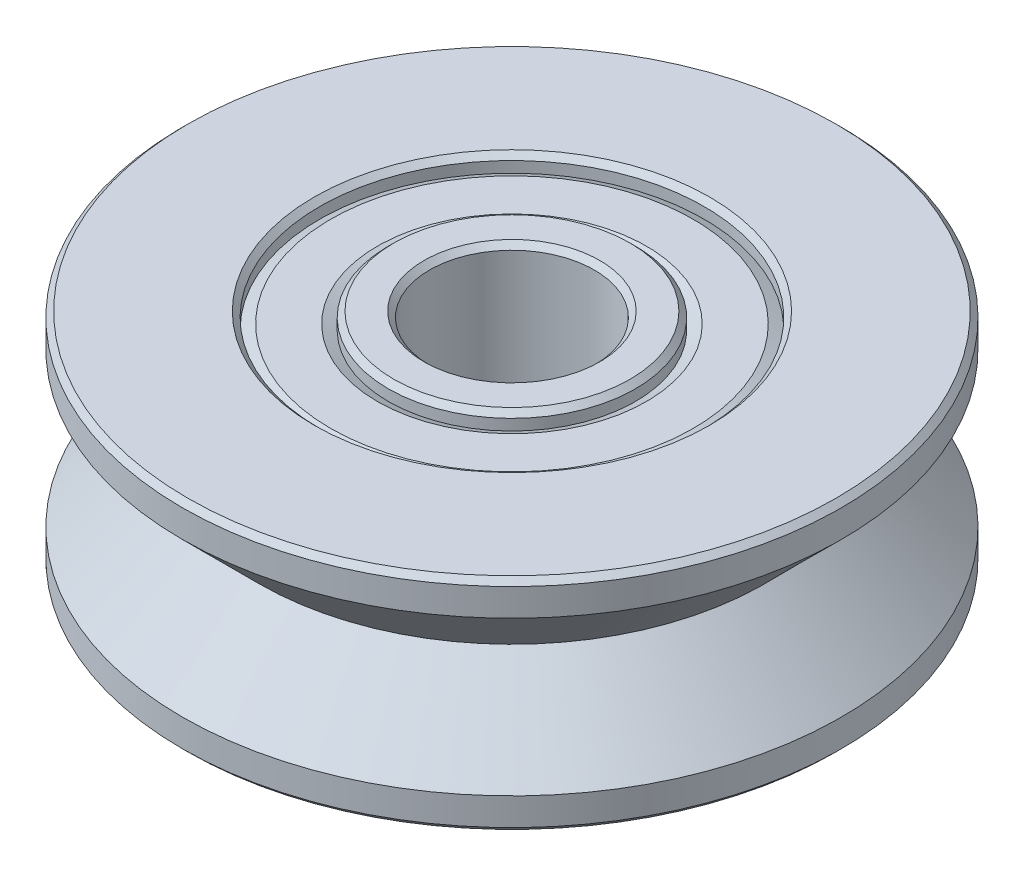
ISO-10303-21;
HEADER;
FILE_DESCRIPTION(('STEP AP214'),'2;1');
FILE_NAME('part.step','',(''),(''),'','','');
FILE_SCHEMA(('AUTOMOTIVE_DESIGN { 1 0 10303 214 1 1 1 1 }'));
ENDSEC;
DATA;
#1=APPLICATION_CONTEXT('core data for automotive mechanical design processes');
#2=APPLICATION_PROTOCOL_DEFINITION('international standard','automotive_design',2000,#1);
#3=PRODUCT_CONTEXT('',#1,'mechanical');
#4=PRODUCT('Part','Part','',(#3));
#5=PRODUCT_RELATED_PRODUCT_CATEGORY('part','',(#4));
#6=PRODUCT_DEFINITION_FORMATION('','',#4);
#7=PRODUCT_DEFINITION_CONTEXT('part definition',#1,'design');
#8=PRODUCT_DEFINITION('design','',#6,#7);
#9=PRODUCT_DEFINITION_SHAPE('','',#8);
#10=(LENGTH_UNIT() NAMED_UNIT(*) SI_UNIT(.MILLI.,.METRE.));
#11=(NAMED_UNIT(*) PLANE_ANGLE_UNIT() SI_UNIT($,.RADIAN.));
#12=(NAMED_UNIT(*) SI_UNIT($,.STERADIAN.) SOLID_ANGLE_UNIT());
#13=UNCERTAINTY_MEASURE_WITH_UNIT(LENGTH_MEASURE(1.E-05),#10,'distance_accuracy_value','');
#14=(GEOMETRIC_REPRESENTATION_CONTEXT(3) GLOBAL_UNCERTAINTY_ASSIGNED_CONTEXT((#13)) GLOBAL_UNIT_ASSIGNED_CONTEXT((#10,
#11,#12)) REPRESENTATION_CONTEXT('',''));
#15=CARTESIAN_POINT('',(0.,0.,0.));
#16=DIRECTION('',(0.,0.,1.));
#17=DIRECTION('',(1.,0.,0.));
#18=AXIS2_PLACEMENT_3D('',#15,#16,#17);
#19=CARTESIAN_POINT('',(0.,-2.,0.));
#20=DIRECTION('',(0.,1.,0.));
#21=DIRECTION('',(0.,0.,1.));
#22=AXIS2_PLACEMENT_3D('',#19,#20,#21);
#23=PLANE('',#22);
#24=CARTESIAN_POINT('',(0.,-2.,0.));
#25=DIRECTION('',(0.,1.,0.));
#26=DIRECTION('',(0.,0.,1.));
#27=AXIS2_PLACEMENT_3D('',#24,#25,#26);
#28=CIRCLE('',#27,3.6);
#29=CARTESIAN_POINT('',(0.,-2.,3.6));
#30=VERTEX_POINT('',#29);
#31=EDGE_CURVE('E64',#30,#30,#28,.T.);
#32=ORIENTED_EDGE('',*,*,#31,.T.);
#33=EDGE_LOOP('',(#32));
#34=FACE_BOUND('',#33,.T.);
#35=CARTESIAN_POINT('',(0.,-2.,0.));
#36=DIRECTION('',(0.,1.,0.));
#37=DIRECTION('',(0.,0.,1.));
#38=AXIS2_PLACEMENT_3D('',#35,#36,#37);
#39=CIRCLE('',#38,5.9);
#40=CARTESIAN_POINT('',(0.,-2.,5.9));
#41=VERTEX_POINT('',#40);
#42=EDGE_CURVE('E67',#41,#41,#39,.F.);
#43=ORIENTED_EDGE('',*,*,#42,.T.);
#44=EDGE_LOOP('',(#43));
#45=FACE_BOUND('',#44,.T.);
#46=ADVANCED_FACE('F38',(#34,#45),#23,.F.);
#47=CARTESIAN_POINT('',(0.,-2.,0.));
#48=DIRECTION('',(0.,1.,0.));
#49=DIRECTION('',(0.,0.,1.));
#50=AXIS2_PLACEMENT_3D('',#47,#48,#49);
#51=CIRCLE('',#50,1.6);
#52=CARTESIAN_POINT('',(0.,-2.,1.6));
#53=VERTEX_POINT('',#52);
#54=EDGE_CURVE('E76',#53,#53,#51,.T.);
#55=ORIENTED_EDGE('',*,*,#54,.T.);
#56=EDGE_LOOP('',(#55));
#57=FACE_BOUND('',#56,.T.);
#58=CARTESIAN_POINT('',(0.,-2.,0.));
#59=DIRECTION('',(0.,1.,0.));
#60=DIRECTION('',(0.,0.,1.));
#61=AXIS2_PLACEMENT_3D('',#58,#59,#60);
#62=CIRCLE('',#61,2.15);
#63=CARTESIAN_POINT('',(0.,-2.,2.15));
#64=VERTEX_POINT('',#63);
#65=EDGE_CURVE('E79',#64,#64,#62,.F.);
#66=ORIENTED_EDGE('',*,*,#65,.T.);
#67=EDGE_LOOP('',(#66));
#68=FACE_BOUND('',#67,.T.);
#69=ADVANCED_FACE('F154',(#57,#68),#23,.F.);
#70=CARTESIAN_POINT('',(0.,2.,0.));
#71=DIRECTION('',(0.,1.,0.));
#72=DIRECTION('',(0.,0.,1.));
#73=AXIS2_PLACEMENT_3D('',#70,#71,#72);
#74=PLANE('',#73);
#75=CARTESIAN_POINT('',(0.,2.,0.));
#76=DIRECTION('',(0.,1.,0.));
#77=DIRECTION('',(0.,0.,1.));
#78=AXIS2_PLACEMENT_3D('',#75,#76,#77);
#79=CIRCLE('',#78,3.6);
#80=CARTESIAN_POINT('',(0.,2.,3.6));
#81=VERTEX_POINT('',#80);
#82=EDGE_CURVE('E49',#81,#81,#79,.F.);
#83=ORIENTED_EDGE('',*,*,#82,.T.);
#84=EDGE_LOOP('',(#83));
#85=FACE_BOUND('',#84,.T.);
#86=CARTESIAN_POINT('',(0.,2.,0.));
#87=DIRECTION('',(0.,1.,0.));
#88=DIRECTION('',(0.,0.,1.));
#89=AXIS2_PLACEMENT_3D('',#86,#87,#88);
#90=CIRCLE('',#89,5.9);
#91=CARTESIAN_POINT('',(0.,2.,5.9));
#92=VERTEX_POINT('',#91);
#93=EDGE_CURVE('E53',#92,#92,#90,.T.);
#94=ORIENTED_EDGE('',*,*,#93,.T.);
#95=EDGE_LOOP('',(#94));
#96=FACE_BOUND('',#95,.T.);
#97=ADVANCED_FACE('F160',(#85,#96),#74,.T.);
#98=CARTESIAN_POINT('',(0.,2.,0.));
#99=DIRECTION('',(0.,1.,0.));
#100=DIRECTION('',(0.,0.,1.));
#101=AXIS2_PLACEMENT_3D('',#98,#99,#100);
#102=CIRCLE('',#101,1.6);
#103=CARTESIAN_POINT('',(0.,2.,1.6));
#104=VERTEX_POINT('',#103);
#105=EDGE_CURVE('E82',#104,#104,#102,.F.);
#106=ORIENTED_EDGE('',*,*,#105,.T.);
#107=EDGE_LOOP('',(#106));
#108=FACE_BOUND('',#107,.T.);
#109=CARTESIAN_POINT('',(0.,2.,0.));
#110=DIRECTION('',(0.,1.,0.));
#111=DIRECTION('',(0.,0.,1.));
#112=AXIS2_PLACEMENT_3D('',#109,#110,#111);
#113=CIRCLE('',#112,2.15);
#114=CARTESIAN_POINT('',(0.,2.,2.15));
#115=VERTEX_POINT('',#114);
#116=EDGE_CURVE('E85',#115,#115,#113,.T.);
#117=ORIENTED_EDGE('',*,*,#116,.T.);
#118=EDGE_LOOP('',(#117));
#119=FACE_BOUND('',#118,.T.);
#120=ADVANCED_FACE('F171',(#108,#119),#74,.T.);
#121=CARTESIAN_POINT('',(0.,2.,0.));
#122=DIRECTION('',(0.,1.,0.));
#123=DIRECTION('',(0.,0.,1.));
#124=AXIS2_PLACEMENT_3D('',#121,#122,#123);
#125=CYLINDRICAL_SURFACE('',#124,1.5);
#126=CARTESIAN_POINT('',(0.,1.9,0.));
#127=DIRECTION('',(0.,1.,0.));
#128=DIRECTION('',(0.,0.,1.));
#129=AXIS2_PLACEMENT_3D('',#126,#127,#128);
#130=CIRCLE('',#129,1.5);
#131=CARTESIAN_POINT('',(0.,1.9,1.5));
#132=VERTEX_POINT('',#131);
#133=EDGE_CURVE('E88',#132,#132,#130,.T.);
#134=ORIENTED_EDGE('',*,*,#133,.T.);
#135=EDGE_LOOP('',(#134));
#136=FACE_BOUND('',#135,.T.);
#137=CARTESIAN_POINT('',(0.,-1.9,0.));
#138=DIRECTION('',(0.,1.,0.));
#139=DIRECTION('',(0.,0.,1.));
#140=AXIS2_PLACEMENT_3D('',#137,#138,#139);
#141=CIRCLE('',#140,1.5);
#142=CARTESIAN_POINT('',(0.,-1.9,1.5));
#143=VERTEX_POINT('',#142);
#144=EDGE_CURVE('E91',#143,#143,#141,.F.);
#145=ORIENTED_EDGE('',*,*,#144,.T.);
#146=EDGE_LOOP('',(#145));
#147=FACE_BOUND('',#146,.T.);
#148=ADVANCED_FACE('F167',(#136,#147),#125,.F.);
#149=CARTESIAN_POINT('',(0.,2.,0.));
#150=DIRECTION('',(0.,1.,0.));
#151=DIRECTION('',(0.,0.,1.));
#152=AXIS2_PLACEMENT_3D('',#149,#150,#151);
#153=CYLINDRICAL_SURFACE('',#152,6.);
#154=CARTESIAN_POINT('',(0.,-1.9,0.));
#155=DIRECTION('',(0.,1.,0.));
#156=DIRECTION('',(0.,0.,1.));
#157=AXIS2_PLACEMENT_3D('',#154,#155,#156);
#158=CIRCLE('',#157,6.);
#159=CARTESIAN_POINT('',(0.,-1.9,6.));
#160=VERTEX_POINT('',#159);
#161=EDGE_CURVE('E45',#160,#160,#158,.T.);
#162=ORIENTED_EDGE('',*,*,#161,.T.);
#163=EDGE_LOOP('',(#162));
#164=FACE_BOUND('',#163,.T.);
#165=CARTESIAN_POINT('',(0.,-1.4,0.));
#166=DIRECTION('',(0.,1.,0.));
#167=DIRECTION('',(0.,0.,1.));
#168=AXIS2_PLACEMENT_3D('',#165,#166,#167);
#169=CIRCLE('',#168,6.);
#170=CARTESIAN_POINT('',(0.,-1.4,6.));
#171=VERTEX_POINT('',#170);
#172=EDGE_CURVE('E94',#171,#171,#169,.T.);
#173=ORIENTED_EDGE('',*,*,#172,.F.);
#174=EDGE_LOOP('',(#173));
#175=FACE_BOUND('',#174,.T.);
#176=ADVANCED_FACE('F170',(#164,#175),#153,.T.);
#177=CARTESIAN_POINT('',(0.,0.,0.));
#178=DIRECTION('',(0.,-1.,0.));
#179=DIRECTION('',(0.,0.,-1.));
#180=AXIS2_PLACEMENT_3D('',#177,#178,#179);
#181=CONICAL_SURFACE('',#180,4.6,0.785398163397448);
#182=ORIENTED_EDGE('',*,*,#172,.T.);
#183=EDGE_LOOP('',(#182));
#184=FACE_BOUND('',#183,.T.);
#185=CARTESIAN_POINT('',(0.,0.,0.));
#186=DIRECTION('',(0.,1.,0.));
#187=DIRECTION('',(0.,0.,1.));
#188=AXIS2_PLACEMENT_3D('',#185,#186,#187);
#189=CIRCLE('',#188,4.6);
#190=CARTESIAN_POINT('',(0.,0.,4.6));
#191=VERTEX_POINT('',#190);
#192=EDGE_CURVE('E97',#191,#191,#189,.T.);
#193=ORIENTED_EDGE('',*,*,#192,.F.);
#194=EDGE_LOOP('',(#193));
#195=FACE_BOUND('',#194,.T.);
#196=ADVANCED_FACE('F165',(#184,#195),#181,.T.);
#197=CARTESIAN_POINT('',(0.,1.4,0.));
#198=DIRECTION('',(0.,1.,0.));
#199=DIRECTION('',(0.,0.,1.));
#200=AXIS2_PLACEMENT_3D('',#197,#198,#199);
#201=CONICAL_SURFACE('',#200,6.,0.785398163397449);
#202=ORIENTED_EDGE('',*,*,#192,.T.);
#203=EDGE_LOOP('',(#202));
#204=FACE_BOUND('',#203,.T.);
#205=CARTESIAN_POINT('',(0.,1.4,0.));
#206=DIRECTION('',(0.,1.,0.));
#207=DIRECTION('',(0.,0.,1.));
#208=AXIS2_PLACEMENT_3D('',#205,#206,#207);
#209=CIRCLE('',#208,6.);
#210=CARTESIAN_POINT('',(0.,1.4,6.));
#211=VERTEX_POINT('',#210);
#212=EDGE_CURVE('E100',#211,#211,#209,.T.);
#213=ORIENTED_EDGE('',*,*,#212,.F.);
#214=EDGE_LOOP('',(#213));
#215=FACE_BOUND('',#214,.T.);
#216=ADVANCED_FACE('F302',(#204,#215),#201,.T.);
#217=CARTESIAN_POINT('',(0.,1.89999999999999,0.));
#218=DIRECTION('',(0.,1.,0.));
#219=DIRECTION('',(0.,0.,1.));
#220=AXIS2_PLACEMENT_3D('',#217,#218,#219);
#221=CIRCLE('',#220,6.);
#222=CARTESIAN_POINT('',(0.,1.89999999999999,6.));
#223=VERTEX_POINT('',#222);
#224=EDGE_CURVE('E10',#223,#223,#221,.F.);
#225=ORIENTED_EDGE('',*,*,#224,.T.);
#226=EDGE_LOOP('',(#225));
#227=FACE_BOUND('',#226,.T.);
#228=ORIENTED_EDGE('',*,*,#212,.T.);
#229=EDGE_LOOP('',(#228));
#230=FACE_BOUND('',#229,.T.);
#231=ADVANCED_FACE('F297',(#227,#230),#153,.T.);
#232=CARTESIAN_POINT('',(0.,1.8,0.));
#233=DIRECTION('',(0.,-1.,0.));
#234=DIRECTION('',(0.,0.,-1.));
#235=AXIS2_PLACEMENT_3D('',#232,#233,#234);
#236=CONICAL_SURFACE('',#235,3.3,1.10714871779409);
#237=CARTESIAN_POINT('',(0.,1.7,0.));
#238=DIRECTION('',(0.,1.,0.));
#239=DIRECTION('',(0.,0.,1.));
#240=AXIS2_PLACEMENT_3D('',#237,#238,#239);
#241=CIRCLE('',#240,3.5);
#242=CARTESIAN_POINT('',(0.,1.7,3.5));
#243=VERTEX_POINT('',#242);
#244=EDGE_CURVE('E103',#243,#243,#241,.T.);
#245=ORIENTED_EDGE('',*,*,#244,.T.);
#246=EDGE_LOOP('',(#245));
#247=FACE_BOUND('',#246,.T.);
#248=CARTESIAN_POINT('',(0.,1.8,0.));
#249=DIRECTION('',(0.,1.,0.));
#250=DIRECTION('',(0.,0.,1.));
#251=AXIS2_PLACEMENT_3D('',#248,#249,#250);
#252=CIRCLE('',#251,3.3);
#253=CARTESIAN_POINT('',(0.,1.8,3.3));
#254=VERTEX_POINT('',#253);
#255=EDGE_CURVE('E112',#254,#254,#252,.T.);
#256=ORIENTED_EDGE('',*,*,#255,.F.);
#257=EDGE_LOOP('',(#256));
#258=FACE_BOUND('',#257,.T.);
#259=ADVANCED_FACE('F289',(#247,#258),#236,.T.);
#260=CARTESIAN_POINT('',(0.,2.,0.));
#261=DIRECTION('',(0.,1.,0.));
#262=DIRECTION('',(0.,0.,1.));
#263=AXIS2_PLACEMENT_3D('',#260,#261,#262);
#264=CYLINDRICAL_SURFACE('',#263,3.5);
#265=CARTESIAN_POINT('',(0.,1.9,0.));
#266=DIRECTION('',(0.,1.,0.));
#267=DIRECTION('',(0.,0.,1.));
#268=AXIS2_PLACEMENT_3D('',#265,#266,#267);
#269=CIRCLE('',#268,3.5);
#270=CARTESIAN_POINT('',(0.,1.9,3.5));
#271=VERTEX_POINT('',#270);
#272=EDGE_CURVE('E58',#271,#271,#269,.T.);
#273=ORIENTED_EDGE('',*,*,#272,.T.);
#274=EDGE_LOOP('',(#273));
#275=FACE_BOUND('',#274,.T.);
#276=ORIENTED_EDGE('',*,*,#244,.F.);
#277=EDGE_LOOP('',(#276));
#278=FACE_BOUND('',#277,.T.);
#279=ADVANCED_FACE('F277',(#275,#278),#264,.F.);
#280=CARTESIAN_POINT('',(0.,2.,0.));
#281=DIRECTION('',(0.,1.,0.));
#282=DIRECTION('',(0.,0.,1.));
#283=AXIS2_PLACEMENT_3D('',#280,#281,#282);
#284=CYLINDRICAL_SURFACE('',#283,2.25);
#285=CARTESIAN_POINT('',(0.,1.9,0.));
#286=DIRECTION('',(0.,1.,0.));
#287=DIRECTION('',(0.,0.,1.));
#288=AXIS2_PLACEMENT_3D('',#285,#286,#287);
#289=CIRCLE('',#288,2.25);
#290=CARTESIAN_POINT('',(0.,1.9,2.25));
#291=VERTEX_POINT('',#290);
#292=EDGE_CURVE('E70',#291,#291,#289,.F.);
#293=ORIENTED_EDGE('',*,*,#292,.T.);
#294=EDGE_LOOP('',(#293));
#295=FACE_BOUND('',#294,.T.);
#296=CARTESIAN_POINT('',(0.,1.7,0.));
#297=DIRECTION('',(0.,1.,0.));
#298=DIRECTION('',(0.,0.,1.));
#299=AXIS2_PLACEMENT_3D('',#296,#297,#298);
#300=CIRCLE('',#299,2.25);
#301=CARTESIAN_POINT('',(0.,1.7,2.25));
#302=VERTEX_POINT('',#301);
#303=EDGE_CURVE('E106',#302,#302,#300,.T.);
#304=ORIENTED_EDGE('',*,*,#303,.T.);
#305=EDGE_LOOP('',(#304));
#306=FACE_BOUND('',#305,.T.);
#307=ADVANCED_FACE('F271',(#295,#306),#284,.T.);
#308=CARTESIAN_POINT('',(0.,1.7,0.));
#309=DIRECTION('',(0.,1.,0.));
#310=DIRECTION('',(0.,0.,1.));
#311=AXIS2_PLACEMENT_3D('',#308,#309,#310);
#312=CONICAL_SURFACE('',#311,2.25,1.10714871779409);
#313=CARTESIAN_POINT('',(0.,1.8,0.));
#314=DIRECTION('',(0.,1.,0.));
#315=DIRECTION('',(0.,0.,1.));
#316=AXIS2_PLACEMENT_3D('',#313,#314,#315);
#317=CIRCLE('',#316,2.45);
#318=CARTESIAN_POINT('',(0.,1.8,2.45));
#319=VERTEX_POINT('',#318);
#320=EDGE_CURVE('E109',#319,#319,#317,.T.);
#321=ORIENTED_EDGE('',*,*,#320,.T.);
#322=EDGE_LOOP('',(#321));
#323=FACE_BOUND('',#322,.T.);
#324=ORIENTED_EDGE('',*,*,#303,.F.);
#325=EDGE_LOOP('',(#324));
#326=FACE_BOUND('',#325,.T.);
#327=ADVANCED_FACE('F276',(#323,#326),#312,.F.);
#328=CARTESIAN_POINT('',(0.,1.8,0.));
#329=DIRECTION('',(0.,1.,0.));
#330=DIRECTION('',(0.,0.,1.));
#331=AXIS2_PLACEMENT_3D('',#328,#329,#330);
#332=PLANE('',#331);
#333=ORIENTED_EDGE('',*,*,#255,.T.);
#334=EDGE_LOOP('',(#333));
#335=FACE_BOUND('',#334,.T.);
#336=ORIENTED_EDGE('',*,*,#320,.F.);
#337=EDGE_LOOP('',(#336));
#338=FACE_BOUND('',#337,.T.);
#339=ADVANCED_FACE('F365',(#335,#338),#332,.T.);
#340=CARTESIAN_POINT('',(0.,-1.8,0.));
#341=DIRECTION('',(0.,1.,0.));
#342=DIRECTION('',(0.,0.,-1.));
#343=AXIS2_PLACEMENT_3D('',#340,#341,#342);
#344=CONICAL_SURFACE('',#343,3.3,1.10714871779409);
#345=CARTESIAN_POINT('',(0.,-1.7,0.));
#346=DIRECTION('',(0.,1.,0.));
#347=DIRECTION('',(0.,0.,1.));
#348=AXIS2_PLACEMENT_3D('',#345,#346,#347);
#349=CIRCLE('',#348,3.5);
#350=CARTESIAN_POINT('',(0.,-1.7,3.5));
#351=VERTEX_POINT('',#350);
#352=EDGE_CURVE('E115',#351,#351,#349,.T.);
#353=ORIENTED_EDGE('',*,*,#352,.F.);
#354=EDGE_LOOP('',(#353));
#355=FACE_BOUND('',#354,.T.);
#356=CARTESIAN_POINT('',(0.,-1.8,0.));
#357=DIRECTION('',(0.,1.,0.));
#358=DIRECTION('',(0.,0.,1.));
#359=AXIS2_PLACEMENT_3D('',#356,#357,#358);
#360=CIRCLE('',#359,3.3);
#361=CARTESIAN_POINT('',(0.,-1.8,3.3));
#362=VERTEX_POINT('',#361);
#363=EDGE_CURVE('E124',#362,#362,#360,.T.);
#364=ORIENTED_EDGE('',*,*,#363,.T.);
#365=EDGE_LOOP('',(#364));
#366=FACE_BOUND('',#365,.T.);
#367=ADVANCED_FACE('F128',(#355,#366),#344,.T.);
#368=CARTESIAN_POINT('',(0.,-2.,0.));
#369=DIRECTION('',(0.,-1.,0.));
#370=DIRECTION('',(0.,0.,1.));
#371=AXIS2_PLACEMENT_3D('',#368,#369,#370);
#372=CYLINDRICAL_SURFACE('',#371,3.5);
#373=CARTESIAN_POINT('',(0.,-1.9,0.));
#374=DIRECTION('',(0.,1.,0.));
#375=DIRECTION('',(0.,0.,1.));
#376=AXIS2_PLACEMENT_3D('',#373,#374,#375);
#377=CIRCLE('',#376,3.5);
#378=CARTESIAN_POINT('',(0.,-1.9,3.5));
#379=VERTEX_POINT('',#378);
#380=EDGE_CURVE('E61',#379,#379,#377,.F.);
#381=ORIENTED_EDGE('',*,*,#380,.T.);
#382=EDGE_LOOP('',(#381));
#383=FACE_BOUND('',#382,.T.);
#384=ORIENTED_EDGE('',*,*,#352,.T.);
#385=EDGE_LOOP('',(#384));
#386=FACE_BOUND('',#385,.T.);
#387=ADVANCED_FACE('F145',(#383,#386),#372,.F.);
#388=CARTESIAN_POINT('',(0.,-2.,0.));
#389=DIRECTION('',(0.,-1.,0.));
#390=DIRECTION('',(0.,0.,1.));
#391=AXIS2_PLACEMENT_3D('',#388,#389,#390);
#392=CYLINDRICAL_SURFACE('',#391,2.25);
#393=CARTESIAN_POINT('',(0.,-1.9,0.));
#394=DIRECTION('',(0.,1.,0.));
#395=DIRECTION('',(0.,0.,1.));
#396=AXIS2_PLACEMENT_3D('',#393,#394,#395);
#397=CIRCLE('',#396,2.25);
#398=CARTESIAN_POINT('',(0.,-1.9,2.25));
#399=VERTEX_POINT('',#398);
#400=EDGE_CURVE('E73',#399,#399,#397,.T.);
#401=ORIENTED_EDGE('',*,*,#400,.T.);
#402=EDGE_LOOP('',(#401));
#403=FACE_BOUND('',#402,.T.);
#404=CARTESIAN_POINT('',(0.,-1.7,0.));
#405=DIRECTION('',(0.,1.,0.));
#406=DIRECTION('',(0.,0.,1.));
#407=AXIS2_PLACEMENT_3D('',#404,#405,#406);
#408=CIRCLE('',#407,2.25);
#409=CARTESIAN_POINT('',(0.,-1.7,2.25));
#410=VERTEX_POINT('',#409);
#411=EDGE_CURVE('E118',#410,#410,#408,.T.);
#412=ORIENTED_EDGE('',*,*,#411,.F.);
#413=EDGE_LOOP('',(#412));
#414=FACE_BOUND('',#413,.T.);
#415=ADVANCED_FACE('F140',(#403,#414),#392,.T.);
#416=CARTESIAN_POINT('',(0.,-1.7,0.));
#417=DIRECTION('',(0.,-1.,0.));
#418=DIRECTION('',(0.,0.,1.));
#419=AXIS2_PLACEMENT_3D('',#416,#417,#418);
#420=CONICAL_SURFACE('',#419,2.25,1.10714871779409);
#421=CARTESIAN_POINT('',(0.,-1.8,0.));
#422=DIRECTION('',(0.,1.,0.));
#423=DIRECTION('',(0.,0.,1.));
#424=AXIS2_PLACEMENT_3D('',#421,#422,#423);
#425=CIRCLE('',#424,2.45);
#426=CARTESIAN_POINT('',(0.,-1.8,2.45));
#427=VERTEX_POINT('',#426);
#428=EDGE_CURVE('E121',#427,#427,#425,.T.);
#429=ORIENTED_EDGE('',*,*,#428,.F.);
#430=EDGE_LOOP('',(#429));
#431=FACE_BOUND('',#430,.T.);
#432=ORIENTED_EDGE('',*,*,#411,.T.);
#433=EDGE_LOOP('',(#432));
#434=FACE_BOUND('',#433,.T.);
#435=ADVANCED_FACE('F134',(#431,#434),#420,.F.);
#436=CARTESIAN_POINT('',(0.,-1.8,0.));
#437=DIRECTION('',(0.,-1.,0.));
#438=DIRECTION('',(0.,0.,1.));
#439=AXIS2_PLACEMENT_3D('',#436,#437,#438);
#440=PLANE('',#439);
#441=ORIENTED_EDGE('',*,*,#363,.F.);
#442=EDGE_LOOP('',(#441));
#443=FACE_BOUND('',#442,.T.);
#444=ORIENTED_EDGE('',*,*,#428,.T.);
#445=EDGE_LOOP('',(#444));
#446=FACE_BOUND('',#445,.T.);
#447=ADVANCED_FACE('F130',(#443,#446),#440,.T.);
#448=CARTESIAN_POINT('',(0.,1.9,0.));
#449=DIRECTION('',(0.,1.,0.));
#450=DIRECTION('',(0.,0.,1.));
#451=AXIS2_PLACEMENT_3D('',#448,#449,#450);
#452=CONICAL_SURFACE('',#451,1.5,0.78539816339745);
#453=ORIENTED_EDGE('',*,*,#105,.F.);
#454=EDGE_LOOP('',(#453));
#455=FACE_BOUND('',#454,.T.);
#456=ORIENTED_EDGE('',*,*,#133,.F.);
#457=EDGE_LOOP('',(#456));
#458=FACE_BOUND('',#457,.T.);
#459=ADVANCED_FACE('F133',(#455,#458),#452,.F.);
#460=CARTESIAN_POINT('',(0.,-2.,0.));
#461=DIRECTION('',(0.,-1.,0.));
#462=DIRECTION('',(0.,0.,-1.));
#463=AXIS2_PLACEMENT_3D('',#460,#461,#462);
#464=CONICAL_SURFACE('',#463,1.6,0.785398163397434);
#465=ORIENTED_EDGE('',*,*,#144,.F.);
#466=EDGE_LOOP('',(#465));
#467=FACE_BOUND('',#466,.T.);
#468=ORIENTED_EDGE('',*,*,#54,.F.);
#469=EDGE_LOOP('',(#468));
#470=FACE_BOUND('',#469,.T.);
#471=ADVANCED_FACE('F178',(#467,#470),#464,.F.);
#472=CARTESIAN_POINT('',(0.,-1.9,0.));
#473=DIRECTION('',(0.,1.,0.));
#474=DIRECTION('',(0.,0.,1.));
#475=AXIS2_PLACEMENT_3D('',#472,#473,#474);
#476=CONICAL_SURFACE('',#475,2.25,0.785398163397446);
#477=ORIENTED_EDGE('',*,*,#65,.F.);
#478=EDGE_LOOP('',(#477));
#479=FACE_BOUND('',#478,.T.);
#480=ORIENTED_EDGE('',*,*,#400,.F.);
#481=EDGE_LOOP('',(#480));
#482=FACE_BOUND('',#481,.T.);
#483=ADVANCED_FACE('F182',(#479,#482),#476,.T.);
#484=CARTESIAN_POINT('',(0.,2.,0.));
#485=DIRECTION('',(0.,-1.,0.));
#486=DIRECTION('',(0.,0.,-1.));
#487=AXIS2_PLACEMENT_3D('',#484,#485,#486);
#488=CONICAL_SURFACE('',#487,2.15,0.785398163397442);
#489=ORIENTED_EDGE('',*,*,#292,.F.);
#490=EDGE_LOOP('',(#489));
#491=FACE_BOUND('',#490,.T.);
#492=ORIENTED_EDGE('',*,*,#116,.F.);
#493=EDGE_LOOP('',(#492));
#494=FACE_BOUND('',#493,.T.);
#495=ADVANCED_FACE('F186',(#491,#494),#488,.T.);
#496=CARTESIAN_POINT('',(0.,-2.,0.));
#497=DIRECTION('',(0.,-1.,0.));
#498=DIRECTION('',(0.,0.,-1.));
#499=AXIS2_PLACEMENT_3D('',#496,#497,#498);
#500=CONICAL_SURFACE('',#499,3.6,0.785398163397438);
#501=ORIENTED_EDGE('',*,*,#380,.F.);
#502=EDGE_LOOP('',(#501));
#503=FACE_BOUND('',#502,.T.);
#504=ORIENTED_EDGE('',*,*,#31,.F.);
#505=EDGE_LOOP('',(#504));
#506=FACE_BOUND('',#505,.T.);
#507=ADVANCED_FACE('F190',(#503,#506),#500,.F.);
#508=CARTESIAN_POINT('',(0.,1.9,0.));
#509=DIRECTION('',(0.,1.,0.));
#510=DIRECTION('',(0.,0.,1.));
#511=AXIS2_PLACEMENT_3D('',#508,#509,#510);
#512=CONICAL_SURFACE('',#511,3.5,0.785398163397442);
#513=ORIENTED_EDGE('',*,*,#82,.F.);
#514=EDGE_LOOP('',(#513));
#515=FACE_BOUND('',#514,.T.);
#516=ORIENTED_EDGE('',*,*,#272,.F.);
#517=EDGE_LOOP('',(#516));
#518=FACE_BOUND('',#517,.T.);
#519=ADVANCED_FACE('F194',(#515,#518),#512,.F.);
#520=CARTESIAN_POINT('',(0.,-1.9,0.));
#521=DIRECTION('',(0.,1.,0.));
#522=DIRECTION('',(0.,0.,1.));
#523=AXIS2_PLACEMENT_3D('',#520,#521,#522);
#524=CONICAL_SURFACE('',#523,6.,0.78539816339745);
#525=ORIENTED_EDGE('',*,*,#42,.F.);
#526=EDGE_LOOP('',(#525));
#527=FACE_BOUND('',#526,.T.);
#528=ORIENTED_EDGE('',*,*,#161,.F.);
#529=EDGE_LOOP('',(#528));
#530=FACE_BOUND('',#529,.T.);
#531=ADVANCED_FACE('F197',(#527,#530),#524,.T.);
#532=CARTESIAN_POINT('',(0.,2.,0.));
#533=DIRECTION('',(0.,-1.,0.));
#534=DIRECTION('',(0.,0.,-1.));
#535=AXIS2_PLACEMENT_3D('',#532,#533,#534);
#536=CONICAL_SURFACE('',#535,5.9,0.78539816339744);
#537=ORIENTED_EDGE('',*,*,#224,.F.);
#538=EDGE_LOOP('',(#537));
#539=FACE_BOUND('',#538,.T.);
#540=ORIENTED_EDGE('',*,*,#93,.F.);
#541=EDGE_LOOP('',(#540));
#542=FACE_BOUND('',#541,.T.);
#543=ADVANCED_FACE('F40',(#539,#542),#536,.T.);
#544=CLOSED_SHELL('',(#46,#69,#97,#120,#148,#176,#196,#216,#231,#259,#279,#307,#327,#339,#367,
#387,#415,#435,#447,#459,#471,#483,#495,#507,#519,#531,#543));
#545=MANIFOLD_SOLID_BREP('B2',#544);
#546=ADVANCED_BREP_SHAPE_REPRESENTATION('',(#18,#545),#14);
#547=SHAPE_DEFINITION_REPRESENTATION(#9,#546);
ENDSEC;
END-ISO-10303-21;
